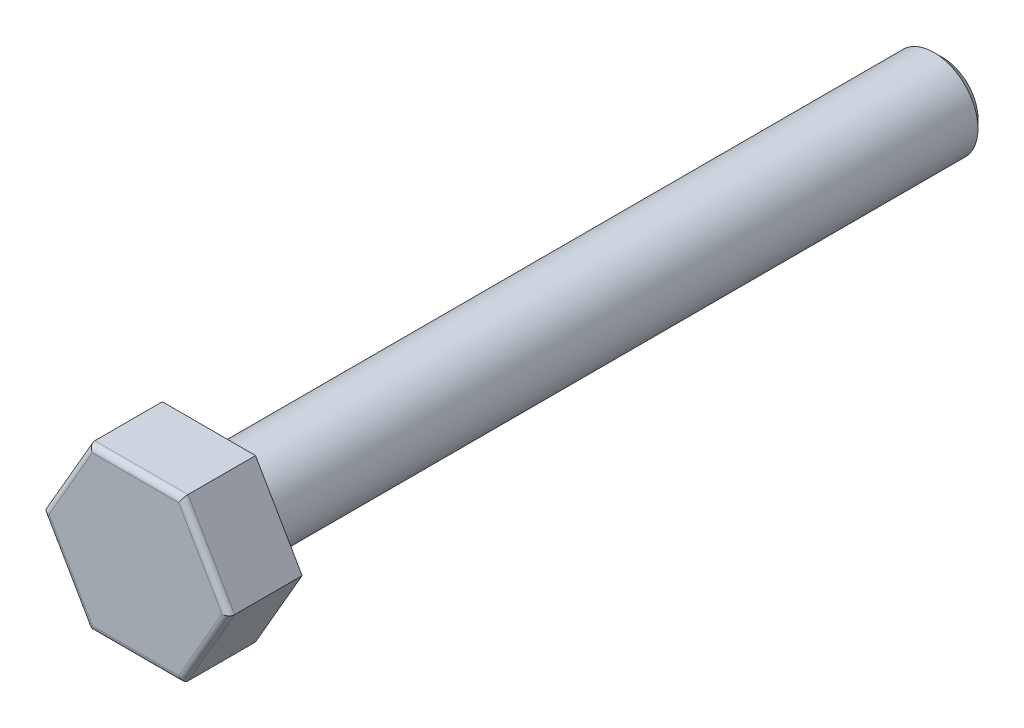
ISO-10303-21;
HEADER;
FILE_DESCRIPTION(('STEP AP214'),'2;1');
FILE_NAME('part.step','',(''),(''),'','','');
FILE_SCHEMA(('AUTOMOTIVE_DESIGN { 1 0 10303 214 1 1 1 1 }'));
ENDSEC;
DATA;
#1=APPLICATION_CONTEXT('core data for automotive mechanical design processes');
#2=APPLICATION_PROTOCOL_DEFINITION('international standard','automotive_design',2000,#1);
#3=PRODUCT_CONTEXT('',#1,'mechanical');
#4=PRODUCT('Part','Part','',(#3));
#5=PRODUCT_RELATED_PRODUCT_CATEGORY('part','',(#4));
#6=PRODUCT_DEFINITION_FORMATION('','',#4);
#7=PRODUCT_DEFINITION_CONTEXT('part definition',#1,'design');
#8=PRODUCT_DEFINITION('design','',#6,#7);
#9=PRODUCT_DEFINITION_SHAPE('','',#8);
#10=(LENGTH_UNIT() NAMED_UNIT(*) SI_UNIT(.MILLI.,.METRE.));
#11=(NAMED_UNIT(*) PLANE_ANGLE_UNIT() SI_UNIT($,.RADIAN.));
#12=(NAMED_UNIT(*) SI_UNIT($,.STERADIAN.) SOLID_ANGLE_UNIT());
#13=UNCERTAINTY_MEASURE_WITH_UNIT(LENGTH_MEASURE(1.E-05),#10,'distance_accuracy_value','');
#14=(GEOMETRIC_REPRESENTATION_CONTEXT(3) GLOBAL_UNCERTAINTY_ASSIGNED_CONTEXT((#13)) GLOBAL_UNIT_ASSIGNED_CONTEXT((#10,
#11,#12)) REPRESENTATION_CONTEXT('',''));
#15=CARTESIAN_POINT('',(0.,0.,0.));
#16=DIRECTION('',(0.,0.,1.));
#17=DIRECTION('',(1.,0.,0.));
#18=AXIS2_PLACEMENT_3D('',#15,#16,#17);
#19=CARTESIAN_POINT('',(0.,0.,0.));
#20=DIRECTION('',(0.,0.,1.));
#21=DIRECTION('',(1.,0.,0.));
#22=AXIS2_PLACEMENT_3D('',#19,#20,#21);
#23=PLANE('',#22);
#24=DIRECTION('',(0.5,0.866025403784439,0.));
#25=VECTOR('',#24,1.);
#26=CARTESIAN_POINT('',(1.58771324027147,-2.75,0.));
#27=LINE('',#26,#25);
#28=CARTESIAN_POINT('',(1.58771324027147,-2.75,0.));
#29=VERTEX_POINT('',#28);
#30=CARTESIAN_POINT('',(3.17542648054294,0.,0.));
#31=VERTEX_POINT('',#30);
#32=EDGE_CURVE('E120',#29,#31,#27,.T.);
#33=ORIENTED_EDGE('',*,*,#32,.F.);
#34=DIRECTION('',(1.,0.,0.));
#35=VECTOR('',#34,1.);
#36=CARTESIAN_POINT('',(-1.58771324027147,-2.75,0.));
#37=LINE('',#36,#35);
#38=CARTESIAN_POINT('',(-1.58771324027147,-2.75,0.));
#39=VERTEX_POINT('',#38);
#40=EDGE_CURVE('E140',#39,#29,#37,.T.);
#41=ORIENTED_EDGE('',*,*,#40,.F.);
#42=DIRECTION('',(0.5,-0.866025403784439,0.));
#43=VECTOR('',#42,1.);
#44=CARTESIAN_POINT('',(-3.17542648054294,0.,0.));
#45=LINE('',#44,#43);
#46=CARTESIAN_POINT('',(-3.17542648054294,0.,0.));
#47=VERTEX_POINT('',#46);
#48=EDGE_CURVE('E137',#47,#39,#45,.T.);
#49=ORIENTED_EDGE('',*,*,#48,.F.);
#50=DIRECTION('',(-0.5,-0.866025403784439,0.));
#51=VECTOR('',#50,1.);
#52=CARTESIAN_POINT('',(-1.58771324027147,2.75,0.));
#53=LINE('',#52,#51);
#54=CARTESIAN_POINT('',(-1.58771324027147,2.75,0.));
#55=VERTEX_POINT('',#54);
#56=EDGE_CURVE('E134',#55,#47,#53,.T.);
#57=ORIENTED_EDGE('',*,*,#56,.F.);
#58=DIRECTION('',(-1.,0.,0.));
#59=VECTOR('',#58,1.);
#60=CARTESIAN_POINT('',(1.58771324027147,2.75,0.));
#61=LINE('',#60,#59);
#62=CARTESIAN_POINT('',(1.58771324027147,2.75,0.));
#63=VERTEX_POINT('',#62);
#64=EDGE_CURVE('E123',#63,#55,#61,.T.);
#65=ORIENTED_EDGE('',*,*,#64,.F.);
#66=DIRECTION('',(-0.5,0.866025403784439,0.));
#67=VECTOR('',#66,1.);
#68=CARTESIAN_POINT('',(3.17542648054294,0.,0.));
#69=LINE('',#68,#67);
#70=EDGE_CURVE('E108',#31,#63,#69,.T.);
#71=ORIENTED_EDGE('',*,*,#70,.F.);
#72=EDGE_LOOP('',(#33,#41,#49,#57,#65,#71));
#73=FACE_BOUND('',#72,.T.);
#74=CARTESIAN_POINT('',(0.,0.,0.));
#75=DIRECTION('',(0.,0.,1.));
#76=DIRECTION('',(1.,0.,0.));
#77=AXIS2_PLACEMENT_3D('',#74,#75,#76);
#78=CIRCLE('',#77,1.5);
#79=CARTESIAN_POINT('',(1.5,0.,0.));
#80=VERTEX_POINT('',#79);
#81=EDGE_CURVE('E113',#80,#80,#78,.F.);
#82=ORIENTED_EDGE('',*,*,#81,.F.);
#83=EDGE_LOOP('',(#82));
#84=FACE_BOUND('',#83,.T.);
#85=ADVANCED_FACE('F35',(#73,#84),#23,.F.);
#86=CARTESIAN_POINT('',(1.58771324027147,-2.75,2.5));
#87=DIRECTION('',(-0.866025403784439,0.5,0.));
#88=DIRECTION('',(-0.5,-0.866025403784439,0.));
#89=AXIS2_PLACEMENT_3D('',#86,#87,#88);
#90=PLANE('',#89);
#91=DIRECTION('',(0.,0.,-1.));
#92=VECTOR('',#91,1.);
#93=CARTESIAN_POINT('',(3.17542648054294,0.,2.5));
#94=LINE('',#93,#92);
#95=CARTESIAN_POINT('',(3.17542648054294,0.,2.3));
#96=VERTEX_POINT('',#95);
#97=EDGE_CURVE('E105',#96,#31,#94,.T.);
#98=ORIENTED_EDGE('',*,*,#97,.F.);
#99=DIRECTION('',(0.5,0.866025403784439,0.));
#100=VECTOR('',#99,1.);
#101=CARTESIAN_POINT('',(1.58771324027147,-2.75,2.3));
#102=LINE('',#101,#100);
#103=CARTESIAN_POINT('',(1.58771324027147,-2.75,2.3));
#104=VERTEX_POINT('',#103);
#105=EDGE_CURVE('E11',#96,#104,#102,.F.);
#106=ORIENTED_EDGE('',*,*,#105,.T.);
#107=DIRECTION('',(0.,0.,-1.));
#108=VECTOR('',#107,1.);
#109=CARTESIAN_POINT('',(1.58771324027147,-2.75,2.5));
#110=LINE('',#109,#108);
#111=EDGE_CURVE('E127',#104,#29,#110,.T.);
#112=ORIENTED_EDGE('',*,*,#111,.T.);
#113=ORIENTED_EDGE('',*,*,#32,.T.);
#114=EDGE_LOOP('',(#98,#106,#112,#113));
#115=FACE_BOUND('',#114,.T.);
#116=ADVANCED_FACE('F125',(#115),#90,.F.);
#117=CARTESIAN_POINT('',(3.17542648054294,0.,2.5));
#118=DIRECTION('',(-0.866025403784439,-0.5,0.));
#119=DIRECTION('',(0.5,-0.866025403784439,0.));
#120=AXIS2_PLACEMENT_3D('',#117,#118,#119);
#121=PLANE('',#120);
#122=DIRECTION('',(0.,0.,-1.));
#123=VECTOR('',#122,1.);
#124=CARTESIAN_POINT('',(1.58771324027147,2.75,2.5));
#125=LINE('',#124,#123);
#126=CARTESIAN_POINT('',(1.58771324027147,2.75,2.3));
#127=VERTEX_POINT('',#126);
#128=EDGE_CURVE('E114',#127,#63,#125,.T.);
#129=ORIENTED_EDGE('',*,*,#128,.F.);
#130=DIRECTION('',(-0.5,0.866025403784439,0.));
#131=VECTOR('',#130,1.);
#132=CARTESIAN_POINT('',(3.17542648054294,0.,2.3));
#133=LINE('',#132,#131);
#134=EDGE_CURVE('E44',#127,#96,#133,.F.);
#135=ORIENTED_EDGE('',*,*,#134,.T.);
#136=ORIENTED_EDGE('',*,*,#97,.T.);
#137=ORIENTED_EDGE('',*,*,#70,.T.);
#138=EDGE_LOOP('',(#129,#135,#136,#137));
#139=FACE_BOUND('',#138,.T.);
#140=ADVANCED_FACE('F107',(#139),#121,.F.);
#141=CARTESIAN_POINT('',(1.58771324027147,2.75,2.5));
#142=DIRECTION('',(0.,-1.,0.));
#143=DIRECTION('',(0.,0.,-1.));
#144=AXIS2_PLACEMENT_3D('',#141,#142,#143);
#145=PLANE('',#144);
#146=DIRECTION('',(0.,0.,-1.));
#147=VECTOR('',#146,1.);
#148=CARTESIAN_POINT('',(-1.58771324027147,2.75,2.5));
#149=LINE('',#148,#147);
#150=CARTESIAN_POINT('',(-1.58771324027147,2.75,2.3));
#151=VERTEX_POINT('',#150);
#152=EDGE_CURVE('E147',#151,#55,#149,.T.);
#153=ORIENTED_EDGE('',*,*,#152,.F.);
#154=DIRECTION('',(-1.,0.,0.));
#155=VECTOR('',#154,1.);
#156=CARTESIAN_POINT('',(1.58771324027147,2.75,2.3));
#157=LINE('',#156,#155);
#158=EDGE_CURVE('E59',#151,#127,#157,.F.);
#159=ORIENTED_EDGE('',*,*,#158,.T.);
#160=ORIENTED_EDGE('',*,*,#128,.T.);
#161=ORIENTED_EDGE('',*,*,#64,.T.);
#162=EDGE_LOOP('',(#153,#159,#160,#161));
#163=FACE_BOUND('',#162,.T.);
#164=ADVANCED_FACE('F249',(#163),#145,.F.);
#165=CARTESIAN_POINT('',(-1.58771324027147,2.75,2.5));
#166=DIRECTION('',(0.866025403784439,-0.5,0.));
#167=DIRECTION('',(0.5,0.866025403784439,0.));
#168=AXIS2_PLACEMENT_3D('',#165,#166,#167);
#169=PLANE('',#168);
#170=DIRECTION('',(0.,0.,-1.));
#171=VECTOR('',#170,1.);
#172=CARTESIAN_POINT('',(-3.17542648054294,0.,2.5));
#173=LINE('',#172,#171);
#174=CARTESIAN_POINT('',(-3.17542648054294,0.,2.3));
#175=VERTEX_POINT('',#174);
#176=EDGE_CURVE('E145',#175,#47,#173,.T.);
#177=ORIENTED_EDGE('',*,*,#176,.F.);
#178=DIRECTION('',(-0.5,-0.866025403784439,0.));
#179=VECTOR('',#178,1.);
#180=CARTESIAN_POINT('',(-1.58771324027147,2.75,2.3));
#181=LINE('',#180,#179);
#182=EDGE_CURVE('E176',#175,#151,#181,.F.);
#183=ORIENTED_EDGE('',*,*,#182,.T.);
#184=ORIENTED_EDGE('',*,*,#152,.T.);
#185=ORIENTED_EDGE('',*,*,#56,.T.);
#186=EDGE_LOOP('',(#177,#183,#184,#185));
#187=FACE_BOUND('',#186,.T.);
#188=ADVANCED_FACE('F223',(#187),#169,.F.);
#189=CARTESIAN_POINT('',(-3.17542648054294,0.,2.5));
#190=DIRECTION('',(0.866025403784439,0.5,0.));
#191=DIRECTION('',(-0.5,0.866025403784439,0.));
#192=AXIS2_PLACEMENT_3D('',#189,#190,#191);
#193=PLANE('',#192);
#194=DIRECTION('',(0.,0.,-1.));
#195=VECTOR('',#194,1.);
#196=CARTESIAN_POINT('',(-1.58771324027147,-2.75,2.5));
#197=LINE('',#196,#195);
#198=CARTESIAN_POINT('',(-1.58771324027147,-2.75,2.3));
#199=VERTEX_POINT('',#198);
#200=EDGE_CURVE('E143',#199,#39,#197,.T.);
#201=ORIENTED_EDGE('',*,*,#200,.F.);
#202=DIRECTION('',(0.5,-0.866025403784439,0.));
#203=VECTOR('',#202,1.);
#204=CARTESIAN_POINT('',(-3.17542648054294,0.,2.3));
#205=LINE('',#204,#203);
#206=EDGE_CURVE('E174',#199,#175,#205,.F.);
#207=ORIENTED_EDGE('',*,*,#206,.T.);
#208=ORIENTED_EDGE('',*,*,#176,.T.);
#209=ORIENTED_EDGE('',*,*,#48,.T.);
#210=EDGE_LOOP('',(#201,#207,#208,#209));
#211=FACE_BOUND('',#210,.T.);
#212=ADVANCED_FACE('F220',(#211),#193,.F.);
#213=CARTESIAN_POINT('',(-1.58771324027147,-2.75,2.5));
#214=DIRECTION('',(0.,1.,0.));
#215=DIRECTION('',(0.,0.,1.));
#216=AXIS2_PLACEMENT_3D('',#213,#214,#215);
#217=PLANE('',#216);
#218=ORIENTED_EDGE('',*,*,#111,.F.);
#219=DIRECTION('',(1.,0.,0.));
#220=VECTOR('',#219,1.);
#221=CARTESIAN_POINT('',(-1.58771324027147,-2.75,2.3));
#222=LINE('',#221,#220);
#223=EDGE_CURVE('E171',#104,#199,#222,.F.);
#224=ORIENTED_EDGE('',*,*,#223,.T.);
#225=ORIENTED_EDGE('',*,*,#200,.T.);
#226=ORIENTED_EDGE('',*,*,#40,.T.);
#227=EDGE_LOOP('',(#218,#224,#225,#226));
#228=FACE_BOUND('',#227,.T.);
#229=ADVANCED_FACE('F209',(#228),#217,.F.);
#230=CARTESIAN_POINT('',(0.,0.,2.5));
#231=DIRECTION('',(0.,0.,1.));
#232=DIRECTION('',(1.,0.,0.));
#233=AXIS2_PLACEMENT_3D('',#230,#231,#232);
#234=PLANE('',#233);
#235=DIRECTION('',(0.5,-0.866025403784439,0.));
#236=VECTOR('',#235,1.);
#237=CARTESIAN_POINT('',(-1.41450815951458,-2.65,2.5));
#238=LINE('',#237,#236);
#239=CARTESIAN_POINT('',(-2.94448637286709,0.,2.5));
#240=VERTEX_POINT('',#239);
#241=CARTESIAN_POINT('',(-1.47224318643354,-2.55,2.5));
#242=VERTEX_POINT('',#241);
#243=EDGE_CURVE('E166',#240,#242,#238,.T.);
#244=ORIENTED_EDGE('',*,*,#243,.T.);
#245=DIRECTION('',(1.,0.,0.));
#246=VECTOR('',#245,1.);
#247=CARTESIAN_POINT('',(1.58771324027147,-2.55,2.5));
#248=LINE('',#247,#246);
#249=CARTESIAN_POINT('',(1.47224318643355,-2.55,2.5));
#250=VERTEX_POINT('',#249);
#251=EDGE_CURVE('E168',#242,#250,#248,.T.);
#252=ORIENTED_EDGE('',*,*,#251,.T.);
#253=DIRECTION('',(0.5,0.866025403784439,0.));
#254=VECTOR('',#253,1.);
#255=CARTESIAN_POINT('',(3.00222139978605,0.1,2.5));
#256=LINE('',#255,#254);
#257=CARTESIAN_POINT('',(2.94448637286709,0.,2.5));
#258=VERTEX_POINT('',#257);
#259=EDGE_CURVE('E158',#250,#258,#256,.T.);
#260=ORIENTED_EDGE('',*,*,#259,.T.);
#261=DIRECTION('',(-0.5,0.866025403784439,0.));
#262=VECTOR('',#261,1.);
#263=CARTESIAN_POINT('',(1.41450815951458,2.65,2.5));
#264=LINE('',#263,#262);
#265=CARTESIAN_POINT('',(1.47224318643355,2.55,2.5));
#266=VERTEX_POINT('',#265);
#267=EDGE_CURVE('E160',#258,#266,#264,.T.);
#268=ORIENTED_EDGE('',*,*,#267,.T.);
#269=DIRECTION('',(-1.,0.,0.));
#270=VECTOR('',#269,1.);
#271=CARTESIAN_POINT('',(-1.58771324027147,2.55,2.5));
#272=LINE('',#271,#270);
#273=CARTESIAN_POINT('',(-1.47224318643355,2.55,2.5));
#274=VERTEX_POINT('',#273);
#275=EDGE_CURVE('E162',#266,#274,#272,.T.);
#276=ORIENTED_EDGE('',*,*,#275,.T.);
#277=DIRECTION('',(-0.5,-0.866025403784439,0.));
#278=VECTOR('',#277,1.);
#279=CARTESIAN_POINT('',(-3.00222139978605,-0.100000000000001,2.5));
#280=LINE('',#279,#278);
#281=EDGE_CURVE('E164',#274,#240,#280,.T.);
#282=ORIENTED_EDGE('',*,*,#281,.T.);
#283=EDGE_LOOP('',(#244,#252,#260,#268,#276,#282));
#284=FACE_BOUND('',#283,.T.);
#285=ADVANCED_FACE('F199',(#284),#234,.T.);
#286=CARTESIAN_POINT('',(0.,0.,-25.));
#287=DIRECTION('',(0.,0.,1.));
#288=DIRECTION('',(1.,0.,0.));
#289=AXIS2_PLACEMENT_3D('',#286,#287,#288);
#290=CYLINDRICAL_SURFACE('',#289,1.5);
#291=CARTESIAN_POINT('',(0.,0.,-24.7));
#292=DIRECTION('',(0.,0.,-1.));
#293=DIRECTION('',(-1.,0.,0.));
#294=AXIS2_PLACEMENT_3D('',#291,#292,#293);
#295=CIRCLE('',#294,1.5);
#296=CARTESIAN_POINT('',(-1.5,0.,-24.7));
#297=VERTEX_POINT('',#296);
#298=EDGE_CURVE('E155',#297,#297,#295,.F.);
#299=ORIENTED_EDGE('',*,*,#298,.T.);
#300=EDGE_LOOP('',(#299));
#301=FACE_BOUND('',#300,.T.);
#302=ORIENTED_EDGE('',*,*,#81,.T.);
#303=EDGE_LOOP('',(#302));
#304=FACE_BOUND('',#303,.T.);
#305=ADVANCED_FACE('F309',(#301,#304),#290,.T.);
#306=CARTESIAN_POINT('',(0.,0.,-25.));
#307=DIRECTION('',(0.,0.,-1.));
#308=DIRECTION('',(-1.,0.,0.));
#309=AXIS2_PLACEMENT_3D('',#306,#307,#308);
#310=PLANE('',#309);
#311=CARTESIAN_POINT('',(0.,0.,-25.));
#312=DIRECTION('',(0.,0.,-1.));
#313=DIRECTION('',(-1.,0.,0.));
#314=AXIS2_PLACEMENT_3D('',#311,#312,#313);
#315=CIRCLE('',#314,1.2);
#316=CARTESIAN_POINT('',(-1.2,0.,-25.));
#317=VERTEX_POINT('',#316);
#318=EDGE_CURVE('E152',#317,#317,#315,.T.);
#319=ORIENTED_EDGE('',*,*,#318,.T.);
#320=EDGE_LOOP('',(#319));
#321=FACE_BOUND('',#320,.T.);
#322=ADVANCED_FACE('F256',(#321),#310,.T.);
#323=CARTESIAN_POINT('',(0.,0.,-25.));
#324=DIRECTION('',(0.,0.,1.));
#325=DIRECTION('',(1.,0.,0.));
#326=AXIS2_PLACEMENT_3D('',#323,#324,#325);
#327=CONICAL_SURFACE('',#326,1.2,0.785398163397452);
#328=ORIENTED_EDGE('',*,*,#298,.F.);
#329=EDGE_LOOP('',(#328));
#330=FACE_BOUND('',#329,.T.);
#331=ORIENTED_EDGE('',*,*,#318,.F.);
#332=EDGE_LOOP('',(#331));
#333=FACE_BOUND('',#332,.T.);
#334=ADVANCED_FACE('F233',(#330,#333),#327,.T.);
#335=CARTESIAN_POINT('',(0.,2.55,2.3));
#336=DIRECTION('',(1.,0.,0.));
#337=DIRECTION('',(0.,0.,-1.));
#338=AXIS2_PLACEMENT_3D('',#335,#336,#337);
#339=CYLINDRICAL_SURFACE('',#338,0.2);
#340=CARTESIAN_POINT('',(1.47224318643355,2.55,2.3));
#341=DIRECTION('',(0.866025403784439,-0.5,0.));
#342=DIRECTION('',(-0.5,-0.866025403784439,0.));
#343=AXIS2_PLACEMENT_3D('',#340,#341,#342);
#344=ELLIPSE('',#343,0.23094010767585,0.2);
#345=EDGE_CURVE('E131',#127,#266,#344,.T.);
#346=ORIENTED_EDGE('',*,*,#345,.F.);
#347=ORIENTED_EDGE('',*,*,#158,.F.);
#348=CARTESIAN_POINT('',(-1.47224318643355,2.55,2.3));
#349=DIRECTION('',(0.866025403784439,0.5,0.));
#350=DIRECTION('',(0.5,-0.866025403784439,0.));
#351=AXIS2_PLACEMENT_3D('',#348,#349,#350);
#352=ELLIPSE('',#351,0.23094010767585,0.2);
#353=EDGE_CURVE('E39',#274,#151,#352,.F.);
#354=ORIENTED_EDGE('',*,*,#353,.F.);
#355=ORIENTED_EDGE('',*,*,#275,.F.);
#356=EDGE_LOOP('',(#346,#347,#354,#355));
#357=FACE_BOUND('',#356,.T.);
#358=ADVANCED_FACE('F37',(#357),#339,.T.);
#359=CARTESIAN_POINT('',(-2.20836477965032,1.275,2.3));
#360=DIRECTION('',(0.5,0.866025403784439,0.));
#361=DIRECTION('',(-0.866025403784439,0.5,0.));
#362=AXIS2_PLACEMENT_3D('',#359,#360,#361);
#363=CYLINDRICAL_SURFACE('',#362,0.2);
#364=ORIENTED_EDGE('',*,*,#353,.T.);
#365=ORIENTED_EDGE('',*,*,#182,.F.);
#366=CARTESIAN_POINT('',(-2.94448637286709,0.,2.3));
#367=DIRECTION('',(0.,1.,0.));
#368=DIRECTION('',(1.,0.,0.));
#369=AXIS2_PLACEMENT_3D('',#366,#367,#368);
#370=ELLIPSE('',#369,0.23094010767585,0.2);
#371=EDGE_CURVE('E187',#240,#175,#370,.F.);
#372=ORIENTED_EDGE('',*,*,#371,.F.);
#373=ORIENTED_EDGE('',*,*,#281,.F.);
#374=EDGE_LOOP('',(#364,#365,#372,#373));
#375=FACE_BOUND('',#374,.T.);
#376=ADVANCED_FACE('F226',(#375),#363,.T.);
#377=CARTESIAN_POINT('',(2.20836477965032,1.275,2.3));
#378=DIRECTION('',(0.5,-0.866025403784439,0.));
#379=DIRECTION('',(0.866025403784439,0.5,0.));
#380=AXIS2_PLACEMENT_3D('',#377,#378,#379);
#381=CYLINDRICAL_SURFACE('',#380,0.2);
#382=ORIENTED_EDGE('',*,*,#345,.T.);
#383=ORIENTED_EDGE('',*,*,#267,.F.);
#384=CARTESIAN_POINT('',(2.94448637286709,0.,2.3));
#385=DIRECTION('',(0.,-1.,0.));
#386=DIRECTION('',(-1.,0.,0.));
#387=AXIS2_PLACEMENT_3D('',#384,#385,#386);
#388=ELLIPSE('',#387,0.23094010767585,0.2);
#389=EDGE_CURVE('E184',#96,#258,#388,.T.);
#390=ORIENTED_EDGE('',*,*,#389,.F.);
#391=ORIENTED_EDGE('',*,*,#134,.F.);
#392=EDGE_LOOP('',(#382,#383,#390,#391));
#393=FACE_BOUND('',#392,.T.);
#394=ADVANCED_FACE('F193',(#393),#381,.T.);
#395=CARTESIAN_POINT('',(-2.20836477965032,-1.275,2.3));
#396=DIRECTION('',(-0.5,0.866025403784439,0.));
#397=DIRECTION('',(-0.866025403784439,-0.5,0.));
#398=AXIS2_PLACEMENT_3D('',#395,#396,#397);
#399=CYLINDRICAL_SURFACE('',#398,0.2);
#400=ORIENTED_EDGE('',*,*,#371,.T.);
#401=ORIENTED_EDGE('',*,*,#206,.F.);
#402=CARTESIAN_POINT('',(-1.47224318643354,-2.55,2.3));
#403=DIRECTION('',(-0.866025403784439,0.5,0.));
#404=DIRECTION('',(0.5,0.866025403784439,0.));
#405=AXIS2_PLACEMENT_3D('',#402,#403,#404);
#406=ELLIPSE('',#405,0.23094010767585,0.2);
#407=EDGE_CURVE('E182',#242,#199,#406,.F.);
#408=ORIENTED_EDGE('',*,*,#407,.F.);
#409=ORIENTED_EDGE('',*,*,#243,.F.);
#410=EDGE_LOOP('',(#400,#401,#408,#409));
#411=FACE_BOUND('',#410,.T.);
#412=ADVANCED_FACE('F217',(#411),#399,.T.);
#413=CARTESIAN_POINT('',(2.20836477965032,-1.275,2.3));
#414=DIRECTION('',(-0.5,-0.866025403784439,0.));
#415=DIRECTION('',(0.866025403784439,-0.5,0.));
#416=AXIS2_PLACEMENT_3D('',#413,#414,#415);
#417=CYLINDRICAL_SURFACE('',#416,0.2);
#418=ORIENTED_EDGE('',*,*,#389,.T.);
#419=ORIENTED_EDGE('',*,*,#259,.F.);
#420=CARTESIAN_POINT('',(1.47224318643355,-2.55,2.3));
#421=DIRECTION('',(-0.866025403784439,-0.5,0.));
#422=DIRECTION('',(0.5,-0.866025403784439,0.));
#423=AXIS2_PLACEMENT_3D('',#420,#421,#422);
#424=ELLIPSE('',#423,0.23094010767585,0.2);
#425=EDGE_CURVE('E180',#104,#250,#424,.T.);
#426=ORIENTED_EDGE('',*,*,#425,.F.);
#427=ORIENTED_EDGE('',*,*,#105,.F.);
#428=EDGE_LOOP('',(#418,#419,#426,#427));
#429=FACE_BOUND('',#428,.T.);
#430=ADVANCED_FACE('F205',(#429),#417,.T.);
#431=CARTESIAN_POINT('',(0.,-2.55,2.3));
#432=DIRECTION('',(-1.,0.,0.));
#433=DIRECTION('',(0.,0.,1.));
#434=AXIS2_PLACEMENT_3D('',#431,#432,#433);
#435=CYLINDRICAL_SURFACE('',#434,0.2);
#436=ORIENTED_EDGE('',*,*,#407,.T.);
#437=ORIENTED_EDGE('',*,*,#223,.F.);
#438=ORIENTED_EDGE('',*,*,#425,.T.);
#439=ORIENTED_EDGE('',*,*,#251,.F.);
#440=EDGE_LOOP('',(#436,#437,#438,#439));
#441=FACE_BOUND('',#440,.T.);
#442=ADVANCED_FACE('F212',(#441),#435,.T.);
#443=CLOSED_SHELL('',(#85,#116,#140,#164,#188,#212,#229,#285,#305,#322,#334,#358,#376,#394,#412,
#430,#442));
#444=MANIFOLD_SOLID_BREP('B2',#443);
#445=ADVANCED_BREP_SHAPE_REPRESENTATION('',(#18,#444),#14);
#446=SHAPE_DEFINITION_REPRESENTATION(#9,#445);
ENDSEC;
END-ISO-10303-21;
